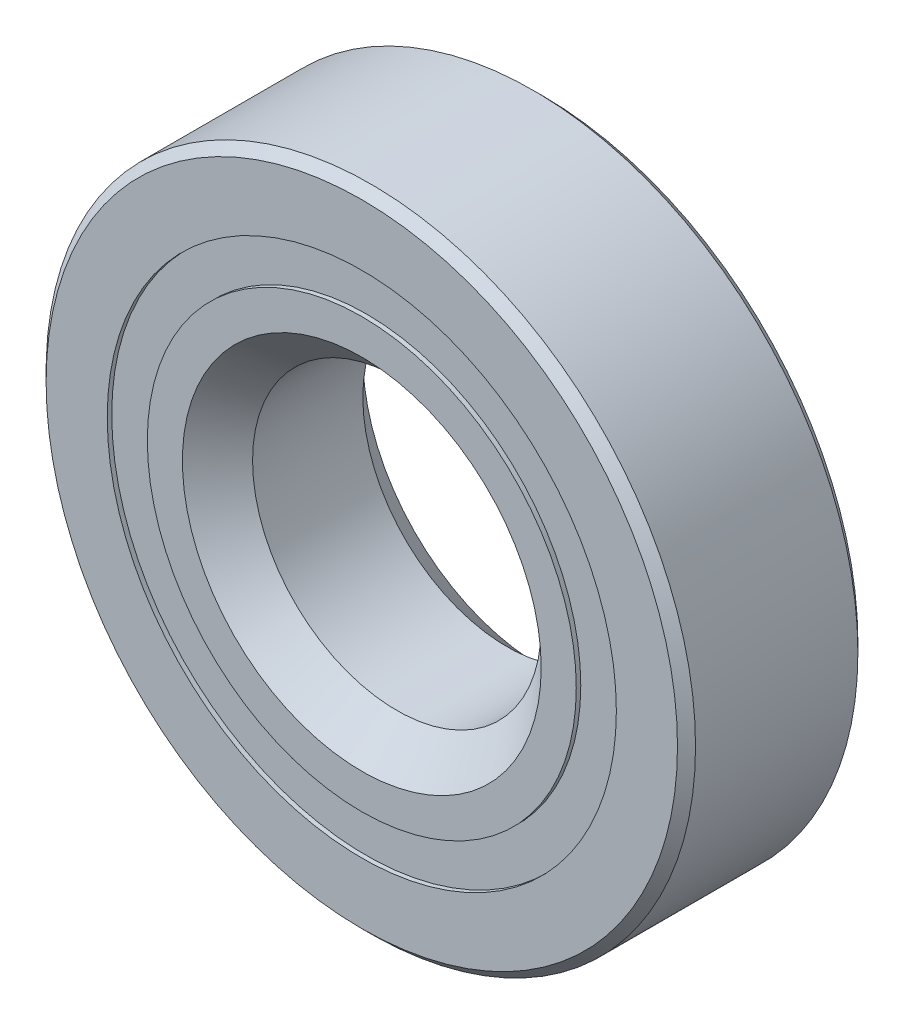
ISO-10303-21;
HEADER;
FILE_DESCRIPTION(('STEP AP214'),'2;1');
FILE_NAME('part.step','',(''),(''),'','','');
FILE_SCHEMA(('AUTOMOTIVE_DESIGN { 1 0 10303 214 1 1 1 1 }'));
ENDSEC;
DATA;
#1=APPLICATION_CONTEXT('core data for automotive mechanical design processes');
#2=APPLICATION_PROTOCOL_DEFINITION('international standard','automotive_design',2000,#1);
#3=PRODUCT_CONTEXT('',#1,'mechanical');
#4=PRODUCT('Part','Part','',(#3));
#5=PRODUCT_RELATED_PRODUCT_CATEGORY('part','',(#4));
#6=PRODUCT_DEFINITION_FORMATION('','',#4);
#7=PRODUCT_DEFINITION_CONTEXT('part definition',#1,'design');
#8=PRODUCT_DEFINITION('design','',#6,#7);
#9=PRODUCT_DEFINITION_SHAPE('','',#8);
#10=(LENGTH_UNIT() NAMED_UNIT(*) SI_UNIT(.MILLI.,.METRE.));
#11=(NAMED_UNIT(*) PLANE_ANGLE_UNIT() SI_UNIT($,.RADIAN.));
#12=(NAMED_UNIT(*) SI_UNIT($,.STERADIAN.) SOLID_ANGLE_UNIT());
#13=UNCERTAINTY_MEASURE_WITH_UNIT(LENGTH_MEASURE(1.E-05),#10,'distance_accuracy_value','');
#14=(GEOMETRIC_REPRESENTATION_CONTEXT(3) GLOBAL_UNCERTAINTY_ASSIGNED_CONTEXT((#13)) GLOBAL_UNIT_ASSIGNED_CONTEXT((#10,
#11,#12)) REPRESENTATION_CONTEXT('',''));
#15=CARTESIAN_POINT('',(0.,0.,0.));
#16=DIRECTION('',(0.,0.,1.));
#17=DIRECTION('',(1.,0.,0.));
#18=AXIS2_PLACEMENT_3D('',#15,#16,#17);
#19=CARTESIAN_POINT('',(0.,11.2006944444444,-1.97208773015606));
#20=DIRECTION('',(0.,0.,-1.));
#21=DIRECTION('',(-1.,0.,0.));
#22=AXIS2_PLACEMENT_3D('',#19,#20,#21);
#23=PLANE('',#22);
#24=CARTESIAN_POINT('',(0.,0.,-1.97208773015606));
#25=DIRECTION('',(0.,0.,1.));
#26=DIRECTION('',(1.,0.,0.));
#27=AXIS2_PLACEMENT_3D('',#24,#25,#26);
#28=CIRCLE('',#27,9.43680555555556);
#29=CARTESIAN_POINT('',(9.43680555555556,0.,-1.97208773015606));
#30=VERTEX_POINT('',#29);
#31=EDGE_CURVE('E11',#30,#30,#28,.T.);
#32=ORIENTED_EDGE('',*,*,#31,.F.);
#33=EDGE_LOOP('',(#32));
#34=FACE_BOUND('',#33,.T.);
#35=CARTESIAN_POINT('',(0.,0.,-1.97208773015606));
#36=DIRECTION('',(0.,0.,1.));
#37=DIRECTION('',(1.,0.,0.));
#38=AXIS2_PLACEMENT_3D('',#35,#36,#37);
#39=CIRCLE('',#38,11.2006944444444);
#40=CARTESIAN_POINT('',(11.2006944444444,0.,-1.97208773015606));
#41=VERTEX_POINT('',#40);
#42=EDGE_CURVE('E59',#41,#41,#39,.T.);
#43=ORIENTED_EDGE('',*,*,#42,.T.);
#44=EDGE_LOOP('',(#43));
#45=FACE_BOUND('',#44,.T.);
#46=ADVANCED_FACE('F45',(#34,#45),#23,.F.);
#47=CARTESIAN_POINT('',(0.,0.,3.96875));
#48=DIRECTION('',(0.,0.,1.));
#49=DIRECTION('',(1.,0.,0.));
#50=AXIS2_PLACEMENT_3D('',#47,#48,#49);
#51=CYLINDRICAL_SURFACE('',#50,9.43680555555556);
#52=CARTESIAN_POINT('',(0.,0.,-3.7703125));
#53=DIRECTION('',(0.,0.,1.));
#54=DIRECTION('',(1.,0.,0.));
#55=AXIS2_PLACEMENT_3D('',#52,#53,#54);
#56=CIRCLE('',#55,9.43680555555556);
#57=CARTESIAN_POINT('',(9.43680555555556,0.,-3.7703125));
#58=VERTEX_POINT('',#57);
#59=EDGE_CURVE('E51',#58,#58,#56,.T.);
#60=ORIENTED_EDGE('',*,*,#59,.F.);
#61=EDGE_LOOP('',(#60));
#62=FACE_BOUND('',#61,.T.);
#63=ORIENTED_EDGE('',*,*,#31,.T.);
#64=EDGE_LOOP('',(#63));
#65=FACE_BOUND('',#64,.T.);
#66=ADVANCED_FACE('F74',(#62,#65),#51,.F.);
#67=CARTESIAN_POINT('',(0.,11.2006944444444,-3.7703125));
#68=DIRECTION('',(0.,0.,1.));
#69=DIRECTION('',(1.,0.,0.));
#70=AXIS2_PLACEMENT_3D('',#67,#68,#69);
#71=PLANE('',#70);
#72=CARTESIAN_POINT('',(0.,0.,-3.7703125));
#73=DIRECTION('',(0.,0.,1.));
#74=DIRECTION('',(1.,0.,0.));
#75=AXIS2_PLACEMENT_3D('',#72,#73,#74);
#76=CIRCLE('',#75,11.2006944444444);
#77=CARTESIAN_POINT('',(11.2006944444444,0.,-3.7703125));
#78=VERTEX_POINT('',#77);
#79=EDGE_CURVE('E55',#78,#78,#76,.T.);
#80=ORIENTED_EDGE('',*,*,#79,.F.);
#81=EDGE_LOOP('',(#80));
#82=FACE_BOUND('',#81,.T.);
#83=ORIENTED_EDGE('',*,*,#59,.T.);
#84=EDGE_LOOP('',(#83));
#85=FACE_BOUND('',#84,.T.);
#86=ADVANCED_FACE('F69',(#82,#85),#71,.F.);
#87=CARTESIAN_POINT('',(0.,0.,3.96875));
#88=DIRECTION('',(0.,0.,1.));
#89=DIRECTION('',(1.,0.,0.));
#90=AXIS2_PLACEMENT_3D('',#87,#88,#89);
#91=CYLINDRICAL_SURFACE('',#90,11.2006944444444);
#92=ORIENTED_EDGE('',*,*,#42,.F.);
#93=EDGE_LOOP('',(#92));
#94=FACE_BOUND('',#93,.T.);
#95=ORIENTED_EDGE('',*,*,#79,.T.);
#96=EDGE_LOOP('',(#95));
#97=FACE_BOUND('',#96,.T.);
#98=ADVANCED_FACE('F66',(#94,#97),#91,.T.);
#99=CLOSED_SHELL('',(#46,#66,#86,#98));
#100=MANIFOLD_SOLID_BREP('B2',#99);
#101=CARTESIAN_POINT('',(0.,11.2006944444444,3.7703125));
#102=DIRECTION('',(0.,0.,-1.));
#103=DIRECTION('',(-1.,0.,0.));
#104=AXIS2_PLACEMENT_3D('',#101,#102,#103);
#105=PLANE('',#104);
#106=CARTESIAN_POINT('',(0.,0.,3.7703125));
#107=DIRECTION('',(0.,0.,1.));
#108=DIRECTION('',(1.,0.,0.));
#109=AXIS2_PLACEMENT_3D('',#106,#107,#108);
#110=CIRCLE('',#109,9.43680555555556);
#111=CARTESIAN_POINT('',(9.43680555555556,0.,3.7703125));
#112=VERTEX_POINT('',#111);
#113=EDGE_CURVE('E44',#112,#112,#110,.T.);
#114=ORIENTED_EDGE('',*,*,#113,.F.);
#115=EDGE_LOOP('',(#114));
#116=FACE_BOUND('',#115,.T.);
#117=CARTESIAN_POINT('',(0.,0.,3.7703125));
#118=DIRECTION('',(0.,0.,1.));
#119=DIRECTION('',(1.,0.,0.));
#120=AXIS2_PLACEMENT_3D('',#117,#118,#119);
#121=CIRCLE('',#120,11.2006944444444);
#122=CARTESIAN_POINT('',(11.2006944444444,0.,3.7703125));
#123=VERTEX_POINT('',#122);
#124=EDGE_CURVE('E126',#123,#123,#121,.T.);
#125=ORIENTED_EDGE('',*,*,#124,.T.);
#126=EDGE_LOOP('',(#125));
#127=FACE_BOUND('',#126,.T.);
#128=ADVANCED_FACE('F112',(#116,#127),#105,.F.);
#129=CARTESIAN_POINT('',(0.,0.,3.96875));
#130=DIRECTION('',(0.,0.,1.));
#131=DIRECTION('',(1.,0.,0.));
#132=AXIS2_PLACEMENT_3D('',#129,#130,#131);
#133=CYLINDRICAL_SURFACE('',#132,9.43680555555556);
#134=CARTESIAN_POINT('',(0.,0.,1.97208773015606));
#135=DIRECTION('',(0.,0.,1.));
#136=DIRECTION('',(1.,0.,0.));
#137=AXIS2_PLACEMENT_3D('',#134,#135,#136);
#138=CIRCLE('',#137,9.43680555555556);
#139=CARTESIAN_POINT('',(9.43680555555556,0.,1.97208773015606));
#140=VERTEX_POINT('',#139);
#141=EDGE_CURVE('E118',#140,#140,#138,.T.);
#142=ORIENTED_EDGE('',*,*,#141,.F.);
#143=EDGE_LOOP('',(#142));
#144=FACE_BOUND('',#143,.T.);
#145=ORIENTED_EDGE('',*,*,#113,.T.);
#146=EDGE_LOOP('',(#145));
#147=FACE_BOUND('',#146,.T.);
#148=ADVANCED_FACE('F141',(#144,#147),#133,.F.);
#149=CARTESIAN_POINT('',(0.,11.2006944444444,1.97208773015606));
#150=DIRECTION('',(0.,0.,1.));
#151=DIRECTION('',(1.,0.,0.));
#152=AXIS2_PLACEMENT_3D('',#149,#150,#151);
#153=PLANE('',#152);
#154=CARTESIAN_POINT('',(0.,0.,1.97208773015606));
#155=DIRECTION('',(0.,0.,1.));
#156=DIRECTION('',(1.,0.,0.));
#157=AXIS2_PLACEMENT_3D('',#154,#155,#156);
#158=CIRCLE('',#157,11.2006944444444);
#159=CARTESIAN_POINT('',(11.2006944444444,0.,1.97208773015606));
#160=VERTEX_POINT('',#159);
#161=EDGE_CURVE('E122',#160,#160,#158,.T.);
#162=ORIENTED_EDGE('',*,*,#161,.F.);
#163=EDGE_LOOP('',(#162));
#164=FACE_BOUND('',#163,.T.);
#165=ORIENTED_EDGE('',*,*,#141,.T.);
#166=EDGE_LOOP('',(#165));
#167=FACE_BOUND('',#166,.T.);
#168=ADVANCED_FACE('F136',(#164,#167),#153,.F.);
#169=CARTESIAN_POINT('',(0.,0.,3.96875));
#170=DIRECTION('',(0.,0.,1.));
#171=DIRECTION('',(1.,0.,0.));
#172=AXIS2_PLACEMENT_3D('',#169,#170,#171);
#173=CYLINDRICAL_SURFACE('',#172,11.2006944444444);
#174=ORIENTED_EDGE('',*,*,#124,.F.);
#175=EDGE_LOOP('',(#174));
#176=FACE_BOUND('',#175,.T.);
#177=ORIENTED_EDGE('',*,*,#161,.T.);
#178=EDGE_LOOP('',(#177));
#179=FACE_BOUND('',#178,.T.);
#180=ADVANCED_FACE('F133',(#176,#179),#173,.T.);
#181=CLOSED_SHELL('',(#128,#148,#168,#180));
#182=MANIFOLD_SOLID_BREP('B6',#181);
#183=CARTESIAN_POINT('',(-4.1970137357383,9.42664719104964,0.));
#184=DIRECTION('',(0.,0.,1.));
#185=DIRECTION('',(-0.406736643075789,0.913545457642606,0.));
#186=AXIS2_PLACEMENT_3D('',#183,#184,#185);
#187=SPHERICAL_SURFACE('',#186,1.97208773015606);
#188=CARTESIAN_POINT('',(-4.1970137357383,9.42664719104964,1.97208773015606));
#189=VERTEX_POINT('',#188);
#190=VERTEX_LOOP('',#189);
#191=FACE_BOUND('',#190,.T.);
#192=ADVANCED_FACE('F179',(#191),#187,.T.);
#193=CLOSED_SHELL('',(#192));
#194=MANIFOLD_SOLID_BREP('B39',#193);
#195=CARTESIAN_POINT('',(-7.66832566789478,6.90459144436556,0.));
#196=DIRECTION('',(0.,0.,1.));
#197=DIRECTION('',(-0.743144825477386,0.669130606358867,0.));
#198=AXIS2_PLACEMENT_3D('',#195,#196,#197);
#199=SPHERICAL_SURFACE('',#198,1.97208773015606);
#200=CARTESIAN_POINT('',(-7.66832566789478,6.90459144436556,1.97208773015606));
#201=VERTEX_POINT('',#200);
#202=VERTEX_LOOP('',#201);
#203=FACE_BOUND('',#202,.T.);
#204=ADVANCED_FACE('F214',(#203),#199,.T.);
#205=CLOSED_SHELL('',(#204));
#206=MANIFOLD_SOLID_BREP('B108',#205);
#207=CARTESIAN_POINT('',(-9.81371442752058,3.18866911070659,0.));
#208=DIRECTION('',(0.,0.,1.));
#209=DIRECTION('',(-0.95105651629515,0.309016994374957,0.));
#210=AXIS2_PLACEMENT_3D('',#207,#208,#209);
#211=SPHERICAL_SURFACE('',#210,1.97208773015606);
#212=CARTESIAN_POINT('',(-9.81371442752058,3.18866911070659,1.97208773015606));
#213=VERTEX_POINT('',#212);
#214=VERTEX_LOOP('',#213);
#215=FACE_BOUND('',#214,.T.);
#216=ADVANCED_FACE('F249',(#215),#211,.T.);
#217=CLOSED_SHELL('',(#216));
#218=MANIFOLD_SOLID_BREP('B175',#217);
#219=CARTESIAN_POINT('',(-10.2622228078314,-1.078603080343,0.));
#220=DIRECTION('',(0.,0.,1.));
#221=DIRECTION('',(-0.994521895368274,-0.104528463267644,0.));
#222=AXIS2_PLACEMENT_3D('',#219,#220,#221);
#223=SPHERICAL_SURFACE('',#222,1.97208773015606);
#224=CARTESIAN_POINT('',(-10.2622228078314,-1.078603080343,1.97208773015606));
#225=VERTEX_POINT('',#224);
#226=VERTEX_LOOP('',#225);
#227=FACE_BOUND('',#226,.T.);
#228=ADVANCED_FACE('F284',(#227),#223,.T.);
#229=CLOSED_SHELL('',(#228));
#230=MANIFOLD_SOLID_BREP('B210',#229);
#231=CARTESIAN_POINT('',(-8.93629963530072,-5.15937499999992,0.));
#232=DIRECTION('',(0.,0.,1.));
#233=DIRECTION('',(-0.866025403784443,-0.499999999999992,0.));
#234=AXIS2_PLACEMENT_3D('',#231,#232,#233);
#235=SPHERICAL_SURFACE('',#234,1.97208773015606);
#236=CARTESIAN_POINT('',(-8.93629963530072,-5.15937499999992,1.97208773015606));
#237=VERTEX_POINT('',#236);
#238=VERTEX_LOOP('',#237);
#239=FACE_BOUND('',#238,.T.);
#240=ADVANCED_FACE('F319',(#239),#235,.T.);
#241=CLOSED_SHELL('',(#240));
#242=MANIFOLD_SOLID_BREP('B245',#241);
#243=CARTESIAN_POINT('',(-6.06520907209303,-8.34804411070644,0.));
#244=DIRECTION('',(0.,0.,1.));
#245=DIRECTION('',(-0.58778525229248,-0.809016994374943,0.));
#246=AXIS2_PLACEMENT_3D('',#243,#244,#245);
#247=SPHERICAL_SURFACE('',#246,1.97208773015606);
#248=CARTESIAN_POINT('',(-6.06520907209303,-8.34804411070644,1.97208773015606));
#249=VERTEX_POINT('',#248);
#250=VERTEX_LOOP('',#249);
#251=FACE_BOUND('',#250,.T.);
#252=ADVANCED_FACE('F354',(#251),#247,.T.);
#253=CLOSED_SHELL('',(#252));
#254=MANIFOLD_SOLID_BREP('B280',#253);
#255=CARTESIAN_POINT('',(-2.14538875962583,-10.0932605550719,0.));
#256=DIRECTION('',(0.,0.,1.));
#257=DIRECTION('',(-0.207911690817766,-0.978147600733804,0.));
#258=AXIS2_PLACEMENT_3D('',#255,#256,#257);
#259=SPHERICAL_SURFACE('',#258,1.97208773015606);
#260=CARTESIAN_POINT('',(-2.14538875962583,-10.0932605550719,1.97208773015606));
#261=VERTEX_POINT('',#260);
#262=VERTEX_LOOP('',#261);
#263=FACE_BOUND('',#262,.T.);
#264=ADVANCED_FACE('F389',(#263),#259,.T.);
#265=CLOSED_SHELL('',(#264));
#266=MANIFOLD_SOLID_BREP('B315',#265);
#267=CARTESIAN_POINT('',(2.14538875962569,-10.093260555072,0.));
#268=DIRECTION('',(0.,0.,1.));
#269=DIRECTION('',(0.207911690817753,-0.978147600733807,0.));
#270=AXIS2_PLACEMENT_3D('',#267,#268,#269);
#271=SPHERICAL_SURFACE('',#270,1.97208773015606);
#272=CARTESIAN_POINT('',(2.14538875962569,-10.093260555072,1.97208773015606));
#273=VERTEX_POINT('',#272);
#274=VERTEX_LOOP('',#273);
#275=FACE_BOUND('',#274,.T.);
#276=ADVANCED_FACE('F424',(#275),#271,.T.);
#277=CLOSED_SHELL('',(#276));
#278=MANIFOLD_SOLID_BREP('B350',#277);
#279=CARTESIAN_POINT('',(6.06520907209291,-8.34804411070652,0.));
#280=DIRECTION('',(0.,0.,1.));
#281=DIRECTION('',(0.587785252292469,-0.80901699437495,0.));
#282=AXIS2_PLACEMENT_3D('',#279,#280,#281);
#283=SPHERICAL_SURFACE('',#282,1.97208773015606);
#284=CARTESIAN_POINT('',(6.06520907209291,-8.34804411070652,1.97208773015606));
#285=VERTEX_POINT('',#284);
#286=VERTEX_LOOP('',#285);
#287=FACE_BOUND('',#286,.T.);
#288=ADVANCED_FACE('F459',(#287),#283,.T.);
#289=CLOSED_SHELL('',(#288));
#290=MANIFOLD_SOLID_BREP('B385',#289);
#291=CARTESIAN_POINT('',(8.93629963530065,-5.15937500000004,0.));
#292=DIRECTION('',(0.,0.,1.));
#293=DIRECTION('',(0.866025403784436,-0.500000000000004,0.));
#294=AXIS2_PLACEMENT_3D('',#291,#292,#293);
#295=SPHERICAL_SURFACE('',#294,1.97208773015606);
#296=CARTESIAN_POINT('',(8.93629963530065,-5.15937500000004,1.97208773015606));
#297=VERTEX_POINT('',#296);
#298=VERTEX_LOOP('',#297);
#299=FACE_BOUND('',#298,.T.);
#300=ADVANCED_FACE('F494',(#299),#295,.T.);
#301=CLOSED_SHELL('',(#300));
#302=MANIFOLD_SOLID_BREP('B420',#301);
#303=CARTESIAN_POINT('',(10.2622228078314,-1.07860308034314,0.));
#304=DIRECTION('',(0.,0.,1.));
#305=DIRECTION('',(0.994521895368273,-0.104528463267657,0.));
#306=AXIS2_PLACEMENT_3D('',#303,#304,#305);
#307=SPHERICAL_SURFACE('',#306,1.97208773015606);
#308=CARTESIAN_POINT('',(10.2622228078314,-1.07860308034314,1.97208773015606));
#309=VERTEX_POINT('',#308);
#310=VERTEX_LOOP('',#309);
#311=FACE_BOUND('',#310,.T.);
#312=ADVANCED_FACE('F529',(#311),#307,.T.);
#313=CLOSED_SHELL('',(#312));
#314=MANIFOLD_SOLID_BREP('B455',#313);
#315=CARTESIAN_POINT('',(9.81371442752062,3.18866911070646,0.));
#316=DIRECTION('',(0.,0.,1.));
#317=DIRECTION('',(0.951056516295154,0.309016994374945,0.));
#318=AXIS2_PLACEMENT_3D('',#315,#316,#317);
#319=SPHERICAL_SURFACE('',#318,1.97208773015606);
#320=CARTESIAN_POINT('',(9.81371442752062,3.18866911070646,1.97208773015606));
#321=VERTEX_POINT('',#320);
#322=VERTEX_LOOP('',#321);
#323=FACE_BOUND('',#322,.T.);
#324=ADVANCED_FACE('F562',(#323),#319,.T.);
#325=CLOSED_SHELL('',(#324));
#326=MANIFOLD_SOLID_BREP('B490',#325);
#327=CARTESIAN_POINT('',(7.66832566789487,6.90459144436545,0.));
#328=DIRECTION('',(0.,0.,1.));
#329=DIRECTION('',(0.743144825477395,0.669130606358857,0.));
#330=AXIS2_PLACEMENT_3D('',#327,#328,#329);
#331=SPHERICAL_SURFACE('',#330,1.97208773015606);
#332=CARTESIAN_POINT('',(7.66832566789487,6.90459144436545,1.97208773015606));
#333=VERTEX_POINT('',#332);
#334=VERTEX_LOOP('',#333);
#335=FACE_BOUND('',#334,.T.);
#336=ADVANCED_FACE('F597',(#335),#331,.T.);
#337=CLOSED_SHELL('',(#336));
#338=MANIFOLD_SOLID_BREP('B525',#337);
#339=CARTESIAN_POINT('',(4.19701373573842,9.42664719104958,0.));
#340=DIRECTION('',(0.,0.,1.));
#341=DIRECTION('',(0.406736643075801,0.913545457642601,0.));
#342=AXIS2_PLACEMENT_3D('',#339,#340,#341);
#343=SPHERICAL_SURFACE('',#342,1.97208773015606);
#344=CARTESIAN_POINT('',(4.19701373573842,9.42664719104958,1.97208773015606));
#345=VERTEX_POINT('',#344);
#346=VERTEX_LOOP('',#345);
#347=FACE_BOUND('',#346,.T.);
#348=ADVANCED_FACE('F630',(#347),#343,.T.);
#349=CLOSED_SHELL('',(#348));
#350=MANIFOLD_SOLID_BREP('B558',#349);
#351=CARTESIAN_POINT('',(0.,10.31875,0.));
#352=DIRECTION('',(0.,0.,1.));
#353=DIRECTION('',(0.,1.,0.));
#354=AXIS2_PLACEMENT_3D('',#351,#352,#353);
#355=SPHERICAL_SURFACE('',#354,1.97208773015606);
#356=CARTESIAN_POINT('',(0.,10.31875,1.97208773015606));
#357=VERTEX_POINT('',#356);
#358=VERTEX_LOOP('',#357);
#359=FACE_BOUND('',#358,.T.);
#360=ADVANCED_FACE('F667',(#359),#355,.T.);
#361=CLOSED_SHELL('',(#360));
#362=MANIFOLD_SOLID_BREP('B593',#361);
#363=CARTESIAN_POINT('',(0.,9.43680555555556,3.96875));
#364=DIRECTION('',(0.,0.,-1.));
#365=DIRECTION('',(-1.,0.,0.));
#366=AXIS2_PLACEMENT_3D('',#363,#364,#365);
#367=PLANE('',#366);
#368=CARTESIAN_POINT('',(0.,0.,3.96875));
#369=DIRECTION('',(0.,0.,1.));
#370=DIRECTION('',(1.,0.,0.));
#371=AXIS2_PLACEMENT_3D('',#368,#369,#370);
#372=CIRCLE('',#371,7.89340277777778);
#373=CARTESIAN_POINT('',(7.89340277777778,0.,3.96875));
#374=VERTEX_POINT('',#373);
#375=EDGE_CURVE('E666',#374,#374,#372,.T.);
#376=ORIENTED_EDGE('',*,*,#375,.F.);
#377=EDGE_LOOP('',(#376));
#378=FACE_BOUND('',#377,.T.);
#379=CARTESIAN_POINT('',(0.,0.,3.96875));
#380=DIRECTION('',(0.,0.,1.));
#381=DIRECTION('',(1.,0.,0.));
#382=AXIS2_PLACEMENT_3D('',#379,#380,#381);
#383=CIRCLE('',#382,9.43680555555556);
#384=CARTESIAN_POINT('',(9.43680555555556,0.,3.96875));
#385=VERTEX_POINT('',#384);
#386=EDGE_CURVE('E714',#385,#385,#383,.T.);
#387=ORIENTED_EDGE('',*,*,#386,.T.);
#388=EDGE_LOOP('',(#387));
#389=FACE_BOUND('',#388,.T.);
#390=ADVANCED_FACE('F686',(#378,#389),#367,.F.);
#391=CARTESIAN_POINT('',(0.,0.,3.96875));
#392=DIRECTION('',(0.,0.,1.));
#393=DIRECTION('',(1.,0.,0.));
#394=AXIS2_PLACEMENT_3D('',#391,#392,#393);
#395=CONICAL_SURFACE('',#394,7.89340277777778,0.78539816339745);
#396=CARTESIAN_POINT('',(0.,0.,2.42534722222223));
#397=DIRECTION('',(0.,0.,1.));
#398=DIRECTION('',(1.,0.,0.));
#399=AXIS2_PLACEMENT_3D('',#396,#397,#398);
#400=CIRCLE('',#399,6.35);
#401=CARTESIAN_POINT('',(6.35,0.,2.42534722222223));
#402=VERTEX_POINT('',#401);
#403=EDGE_CURVE('E692',#402,#402,#400,.T.);
#404=ORIENTED_EDGE('',*,*,#403,.F.);
#405=EDGE_LOOP('',(#404));
#406=FACE_BOUND('',#405,.T.);
#407=ORIENTED_EDGE('',*,*,#375,.T.);
#408=EDGE_LOOP('',(#407));
#409=FACE_BOUND('',#408,.T.);
#410=ADVANCED_FACE('F751',(#406,#409),#395,.F.);
#411=CARTESIAN_POINT('',(0.,0.,3.96875));
#412=DIRECTION('',(0.,0.,1.));
#413=DIRECTION('',(1.,0.,0.));
#414=AXIS2_PLACEMENT_3D('',#411,#412,#413);
#415=CYLINDRICAL_SURFACE('',#414,6.35);
#416=CARTESIAN_POINT('',(0.,0.,-2.42534722222223));
#417=DIRECTION('',(0.,0.,1.));
#418=DIRECTION('',(1.,0.,0.));
#419=AXIS2_PLACEMENT_3D('',#416,#417,#418);
#420=CIRCLE('',#419,6.35);
#421=CARTESIAN_POINT('',(6.35,0.,-2.42534722222223));
#422=VERTEX_POINT('',#421);
#423=EDGE_CURVE('E696',#422,#422,#420,.T.);
#424=ORIENTED_EDGE('',*,*,#423,.F.);
#425=EDGE_LOOP('',(#424));
#426=FACE_BOUND('',#425,.T.);
#427=ORIENTED_EDGE('',*,*,#403,.T.);
#428=EDGE_LOOP('',(#427));
#429=FACE_BOUND('',#428,.T.);
#430=ADVANCED_FACE('F746',(#426,#429),#415,.F.);
#431=CARTESIAN_POINT('',(0.,0.,-2.42534722222223));
#432=DIRECTION('',(0.,0.,-1.));
#433=DIRECTION('',(-1.,0.,0.));
#434=AXIS2_PLACEMENT_3D('',#431,#432,#433);
#435=CONICAL_SURFACE('',#434,6.35,0.78539816339745);
#436=CARTESIAN_POINT('',(0.,0.,-3.96875));
#437=DIRECTION('',(0.,0.,1.));
#438=DIRECTION('',(1.,0.,0.));
#439=AXIS2_PLACEMENT_3D('',#436,#437,#438);
#440=CIRCLE('',#439,7.89340277777778);
#441=CARTESIAN_POINT('',(7.89340277777778,0.,-3.96875));
#442=VERTEX_POINT('',#441);
#443=EDGE_CURVE('E700',#442,#442,#440,.T.);
#444=ORIENTED_EDGE('',*,*,#443,.F.);
#445=EDGE_LOOP('',(#444));
#446=FACE_BOUND('',#445,.T.);
#447=ORIENTED_EDGE('',*,*,#423,.T.);
#448=EDGE_LOOP('',(#447));
#449=FACE_BOUND('',#448,.T.);
#450=ADVANCED_FACE('F740',(#446,#449),#435,.F.);
#451=CARTESIAN_POINT('',(0.,9.43680555555556,-3.96875));
#452=DIRECTION('',(0.,0.,1.));
#453=DIRECTION('',(1.,0.,0.));
#454=AXIS2_PLACEMENT_3D('',#451,#452,#453);
#455=PLANE('',#454);
#456=CARTESIAN_POINT('',(0.,0.,-3.96875));
#457=DIRECTION('',(0.,0.,1.));
#458=DIRECTION('',(1.,0.,0.));
#459=AXIS2_PLACEMENT_3D('',#456,#457,#458);
#460=CIRCLE('',#459,9.43680555555556);
#461=CARTESIAN_POINT('',(9.43680555555556,0.,-3.96875));
#462=VERTEX_POINT('',#461);
#463=EDGE_CURVE('E705',#462,#462,#460,.T.);
#464=ORIENTED_EDGE('',*,*,#463,.F.);
#465=EDGE_LOOP('',(#464));
#466=FACE_BOUND('',#465,.T.);
#467=ORIENTED_EDGE('',*,*,#443,.T.);
#468=EDGE_LOOP('',(#467));
#469=FACE_BOUND('',#468,.T.);
#470=ADVANCED_FACE('F734',(#466,#469),#455,.F.);
#471=CARTESIAN_POINT('',(0.,0.,3.96875));
#472=DIRECTION('',(0.,0.,1.));
#473=DIRECTION('',(1.,0.,0.));
#474=AXIS2_PLACEMENT_3D('',#471,#472,#473);
#475=CYLINDRICAL_SURFACE('',#474,9.43680555555556);
#476=CARTESIAN_POINT('',(0.,0.,-1.76388888888889));
#477=DIRECTION('',(0.,0.,1.));
#478=DIRECTION('',(1.,0.,0.));
#479=AXIS2_PLACEMENT_3D('',#476,#477,#478);
#480=CIRCLE('',#479,9.43680555555556);
#481=CARTESIAN_POINT('',(9.43680555555556,0.,-1.76388888888889));
#482=VERTEX_POINT('',#481);
#483=EDGE_CURVE('E708',#482,#482,#480,.T.);
#484=ORIENTED_EDGE('',*,*,#483,.F.);
#485=EDGE_LOOP('',(#484));
#486=FACE_BOUND('',#485,.T.);
#487=ORIENTED_EDGE('',*,*,#463,.T.);
#488=EDGE_LOOP('',(#487));
#489=FACE_BOUND('',#488,.T.);
#490=ADVANCED_FACE('F728',(#486,#489),#475,.T.);
#491=CARTESIAN_POINT('',(0.,0.,0.));
#492=DIRECTION('',(0.,0.,1.));
#493=DIRECTION('',(1.,0.,0.));
#494=AXIS2_PLACEMENT_3D('',#491,#492,#493);
#495=TOROIDAL_SURFACE('',#494,10.31875,1.97208773015606);
#496=CARTESIAN_POINT('',(0.,0.,1.76388888888889));
#497=DIRECTION('',(0.,0.,1.));
#498=DIRECTION('',(1.,0.,0.));
#499=AXIS2_PLACEMENT_3D('',#496,#497,#498);
#500=CIRCLE('',#499,9.43680555555556);
#501=CARTESIAN_POINT('',(9.43680555555556,0.,1.76388888888889));
#502=VERTEX_POINT('',#501);
#503=EDGE_CURVE('E711',#502,#502,#500,.T.);
#504=ORIENTED_EDGE('',*,*,#503,.F.);
#505=EDGE_LOOP('',(#504));
#506=FACE_BOUND('',#505,.T.);
#507=ORIENTED_EDGE('',*,*,#483,.T.);
#508=EDGE_LOOP('',(#507));
#509=FACE_BOUND('',#508,.T.);
#510=ADVANCED_FACE('F722',(#506,#509),#495,.F.);
#511=CARTESIAN_POINT('',(0.,0.,3.96875));
#512=DIRECTION('',(0.,0.,1.));
#513=DIRECTION('',(1.,0.,0.));
#514=AXIS2_PLACEMENT_3D('',#511,#512,#513);
#515=CYLINDRICAL_SURFACE('',#514,9.43680555555556);
#516=ORIENTED_EDGE('',*,*,#386,.F.);
#517=EDGE_LOOP('',(#516));
#518=FACE_BOUND('',#517,.T.);
#519=ORIENTED_EDGE('',*,*,#503,.T.);
#520=EDGE_LOOP('',(#519));
#521=FACE_BOUND('',#520,.T.);
#522=ADVANCED_FACE('F719',(#518,#521),#515,.T.);
#523=CLOSED_SHELL('',(#390,#410,#430,#450,#470,#490,#510,#522));
#524=MANIFOLD_SOLID_BREP('B626',#523);
#525=CARTESIAN_POINT('',(0.,0.,3.571875));
#526=DIRECTION('',(0.,0.,-1.));
#527=DIRECTION('',(-1.,0.,0.));
#528=AXIS2_PLACEMENT_3D('',#525,#526,#527);
#529=CONICAL_SURFACE('',#528,14.2875,0.785398163397448);
#530=CARTESIAN_POINT('',(0.,0.,3.96875));
#531=DIRECTION('',(0.,0.,1.));
#532=DIRECTION('',(1.,0.,0.));
#533=AXIS2_PLACEMENT_3D('',#530,#531,#532);
#534=CIRCLE('',#533,13.890625);
#535=CARTESIAN_POINT('',(13.890625,0.,3.96875));
#536=VERTEX_POINT('',#535);
#537=EDGE_CURVE('E835',#536,#536,#534,.T.);
#538=ORIENTED_EDGE('',*,*,#537,.F.);
#539=EDGE_LOOP('',(#538));
#540=FACE_BOUND('',#539,.T.);
#541=CARTESIAN_POINT('',(0.,0.,3.571875));
#542=DIRECTION('',(0.,0.,1.));
#543=DIRECTION('',(1.,0.,0.));
#544=AXIS2_PLACEMENT_3D('',#541,#542,#543);
#545=CIRCLE('',#544,14.2875);
#546=CARTESIAN_POINT('',(14.2875,0.,3.571875));
#547=VERTEX_POINT('',#546);
#548=EDGE_CURVE('E685',#547,#547,#545,.T.);
#549=ORIENTED_EDGE('',*,*,#548,.T.);
#550=EDGE_LOOP('',(#549));
#551=FACE_BOUND('',#550,.T.);
#552=ADVANCED_FACE('F807',(#540,#551),#529,.T.);
#553=CARTESIAN_POINT('',(0.,0.,3.96875));
#554=DIRECTION('',(0.,0.,1.));
#555=DIRECTION('',(1.,0.,0.));
#556=AXIS2_PLACEMENT_3D('',#553,#554,#555);
#557=CYLINDRICAL_SURFACE('',#556,14.2875);
#558=ORIENTED_EDGE('',*,*,#548,.F.);
#559=EDGE_LOOP('',(#558));
#560=FACE_BOUND('',#559,.T.);
#561=CARTESIAN_POINT('',(0.,0.,-3.571875));
#562=DIRECTION('',(0.,0.,1.));
#563=DIRECTION('',(1.,0.,0.));
#564=AXIS2_PLACEMENT_3D('',#561,#562,#563);
#565=CIRCLE('',#564,14.2875);
#566=CARTESIAN_POINT('',(14.2875,0.,-3.571875));
#567=VERTEX_POINT('',#566);
#568=EDGE_CURVE('E813',#567,#567,#565,.T.);
#569=ORIENTED_EDGE('',*,*,#568,.T.);
#570=EDGE_LOOP('',(#569));
#571=FACE_BOUND('',#570,.T.);
#572=ADVANCED_FACE('F842',(#560,#571),#557,.T.);
#573=CARTESIAN_POINT('',(0.,0.,-3.96875));
#574=DIRECTION('',(0.,0.,1.));
#575=DIRECTION('',(1.,0.,0.));
#576=AXIS2_PLACEMENT_3D('',#573,#574,#575);
#577=CONICAL_SURFACE('',#576,13.890625,0.785398163397448);
#578=ORIENTED_EDGE('',*,*,#568,.F.);
#579=EDGE_LOOP('',(#578));
#580=FACE_BOUND('',#579,.T.);
#581=CARTESIAN_POINT('',(0.,0.,-3.96875));
#582=DIRECTION('',(0.,0.,1.));
#583=DIRECTION('',(1.,0.,0.));
#584=AXIS2_PLACEMENT_3D('',#581,#582,#583);
#585=CIRCLE('',#584,13.890625);
#586=CARTESIAN_POINT('',(13.890625,0.,-3.96875));
#587=VERTEX_POINT('',#586);
#588=EDGE_CURVE('E817',#587,#587,#585,.T.);
#589=ORIENTED_EDGE('',*,*,#588,.T.);
#590=EDGE_LOOP('',(#589));
#591=FACE_BOUND('',#590,.T.);
#592=ADVANCED_FACE('F846',(#580,#591),#577,.T.);
#593=CARTESIAN_POINT('',(0.,13.890625,-3.96875));
#594=DIRECTION('',(0.,0.,1.));
#595=DIRECTION('',(1.,0.,0.));
#596=AXIS2_PLACEMENT_3D('',#593,#594,#595);
#597=PLANE('',#596);
#598=ORIENTED_EDGE('',*,*,#588,.F.);
#599=EDGE_LOOP('',(#598));
#600=FACE_BOUND('',#599,.T.);
#601=CARTESIAN_POINT('',(0.,0.,-3.96875));
#602=DIRECTION('',(0.,0.,1.));
#603=DIRECTION('',(1.,0.,0.));
#604=AXIS2_PLACEMENT_3D('',#601,#602,#603);
#605=CIRCLE('',#604,11.2006944444444);
#606=CARTESIAN_POINT('',(11.2006944444444,0.,-3.96875));
#607=VERTEX_POINT('',#606);
#608=EDGE_CURVE('E821',#607,#607,#605,.T.);
#609=ORIENTED_EDGE('',*,*,#608,.T.);
#610=EDGE_LOOP('',(#609));
#611=FACE_BOUND('',#610,.T.);
#612=ADVANCED_FACE('F851',(#600,#611),#597,.F.);
#613=CARTESIAN_POINT('',(0.,0.,3.96875));
#614=DIRECTION('',(0.,0.,1.));
#615=DIRECTION('',(1.,0.,0.));
#616=AXIS2_PLACEMENT_3D('',#613,#614,#615);
#617=CYLINDRICAL_SURFACE('',#616,11.2006944444444);
#618=ORIENTED_EDGE('',*,*,#608,.F.);
#619=EDGE_LOOP('',(#618));
#620=FACE_BOUND('',#619,.T.);
#621=CARTESIAN_POINT('',(0.,0.,-1.76388888888889));
#622=DIRECTION('',(0.,0.,1.));
#623=DIRECTION('',(1.,0.,0.));
#624=AXIS2_PLACEMENT_3D('',#621,#622,#623);
#625=CIRCLE('',#624,11.2006944444444);
#626=CARTESIAN_POINT('',(11.2006944444444,0.,-1.76388888888889));
#627=VERTEX_POINT('',#626);
#628=EDGE_CURVE('E826',#627,#627,#625,.T.);
#629=ORIENTED_EDGE('',*,*,#628,.T.);
#630=EDGE_LOOP('',(#629));
#631=FACE_BOUND('',#630,.T.);
#632=ADVANCED_FACE('F857',(#620,#631),#617,.F.);
#633=CARTESIAN_POINT('',(0.,0.,0.));
#634=DIRECTION('',(0.,0.,1.));
#635=DIRECTION('',(1.,0.,0.));
#636=AXIS2_PLACEMENT_3D('',#633,#634,#635);
#637=TOROIDAL_SURFACE('',#636,10.31875,1.97208773015606);
#638=ORIENTED_EDGE('',*,*,#628,.F.);
#639=EDGE_LOOP('',(#638));
#640=FACE_BOUND('',#639,.T.);
#641=CARTESIAN_POINT('',(0.,0.,1.76388888888889));
#642=DIRECTION('',(0.,0.,1.));
#643=DIRECTION('',(1.,0.,0.));
#644=AXIS2_PLACEMENT_3D('',#641,#642,#643);
#645=CIRCLE('',#644,11.2006944444444);
#646=CARTESIAN_POINT('',(11.2006944444444,0.,1.76388888888889));
#647=VERTEX_POINT('',#646);
#648=EDGE_CURVE('E829',#647,#647,#645,.T.);
#649=ORIENTED_EDGE('',*,*,#648,.T.);
#650=EDGE_LOOP('',(#649));
#651=FACE_BOUND('',#650,.T.);
#652=ADVANCED_FACE('F861',(#640,#651),#637,.F.);
#653=CARTESIAN_POINT('',(0.,0.,3.96875));
#654=DIRECTION('',(0.,0.,1.));
#655=DIRECTION('',(1.,0.,0.));
#656=AXIS2_PLACEMENT_3D('',#653,#654,#655);
#657=CYLINDRICAL_SURFACE('',#656,11.2006944444444);
#658=ORIENTED_EDGE('',*,*,#648,.F.);
#659=EDGE_LOOP('',(#658));
#660=FACE_BOUND('',#659,.T.);
#661=CARTESIAN_POINT('',(0.,0.,3.96875));
#662=DIRECTION('',(0.,0.,1.));
#663=DIRECTION('',(1.,0.,0.));
#664=AXIS2_PLACEMENT_3D('',#661,#662,#663);
#665=CIRCLE('',#664,11.2006944444444);
#666=CARTESIAN_POINT('',(11.2006944444444,0.,3.96875));
#667=VERTEX_POINT('',#666);
#668=EDGE_CURVE('E832',#667,#667,#665,.T.);
#669=ORIENTED_EDGE('',*,*,#668,.T.);
#670=EDGE_LOOP('',(#669));
#671=FACE_BOUND('',#670,.T.);
#672=ADVANCED_FACE('F865',(#660,#671),#657,.F.);
#673=CARTESIAN_POINT('',(0.,13.890625,3.96875));
#674=DIRECTION('',(0.,0.,-1.));
#675=DIRECTION('',(-1.,0.,0.));
#676=AXIS2_PLACEMENT_3D('',#673,#674,#675);
#677=PLANE('',#676);
#678=ORIENTED_EDGE('',*,*,#668,.F.);
#679=EDGE_LOOP('',(#678));
#680=FACE_BOUND('',#679,.T.);
#681=ORIENTED_EDGE('',*,*,#537,.T.);
#682=EDGE_LOOP('',(#681));
#683=FACE_BOUND('',#682,.T.);
#684=ADVANCED_FACE('F839',(#680,#683),#677,.F.);
#685=CLOSED_SHELL('',(#552,#572,#592,#612,#632,#652,#672,#684));
#686=MANIFOLD_SOLID_BREP('B661',#685);
#687=ADVANCED_BREP_SHAPE_REPRESENTATION('',(#18,#100,#182,#194,#206,#218,#230,#242,#254,#266,
#278,#290,#302,#314,#326,#338,#350,#362,#524,#686),#14);
#688=SHAPE_DEFINITION_REPRESENTATION(#9,#687);
ENDSEC;
END-ISO-10303-21;
